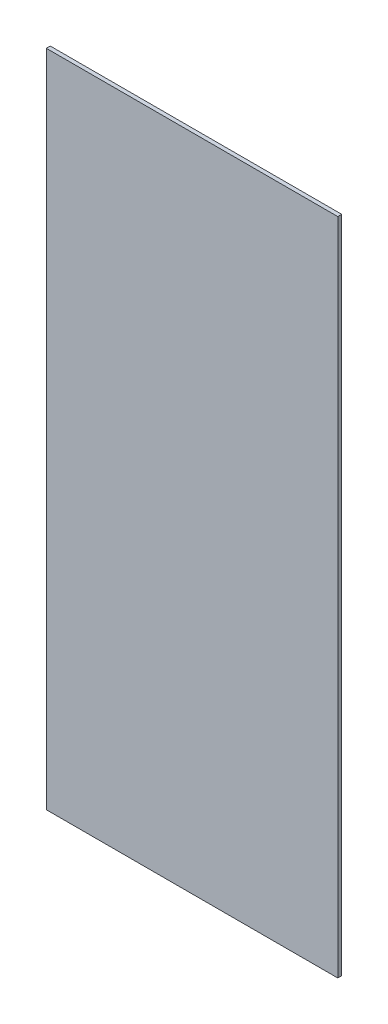
ISO-10303-21;
HEADER;
FILE_DESCRIPTION(('STEP AP214'),'2;1');
FILE_NAME('part.step','',(''),(''),'','','');
FILE_SCHEMA(('AUTOMOTIVE_DESIGN { 1 0 10303 214 1 1 1 1 }'));
ENDSEC;
DATA;
#1=APPLICATION_CONTEXT('core data for automotive mechanical design processes');
#2=APPLICATION_PROTOCOL_DEFINITION('international standard','automotive_design',2000,#1);
#3=PRODUCT_CONTEXT('',#1,'mechanical');
#4=PRODUCT('Part','Part','',(#3));
#5=PRODUCT_RELATED_PRODUCT_CATEGORY('part','',(#4));
#6=PRODUCT_DEFINITION_FORMATION('','',#4);
#7=PRODUCT_DEFINITION_CONTEXT('part definition',#1,'design');
#8=PRODUCT_DEFINITION('design','',#6,#7);
#9=PRODUCT_DEFINITION_SHAPE('','',#8);
#10=(LENGTH_UNIT() NAMED_UNIT(*) SI_UNIT(.MILLI.,.METRE.));
#11=(NAMED_UNIT(*) PLANE_ANGLE_UNIT() SI_UNIT($,.RADIAN.));
#12=(NAMED_UNIT(*) SI_UNIT($,.STERADIAN.) SOLID_ANGLE_UNIT());
#13=UNCERTAINTY_MEASURE_WITH_UNIT(LENGTH_MEASURE(1.E-05),#10,'distance_accuracy_value','');
#14=(GEOMETRIC_REPRESENTATION_CONTEXT(3) GLOBAL_UNCERTAINTY_ASSIGNED_CONTEXT((#13)) GLOBAL_UNIT_ASSIGNED_CONTEXT((#10,
#11,#12)) REPRESENTATION_CONTEXT('',''));
#15=CARTESIAN_POINT('',(0.,0.,0.));
#16=DIRECTION('',(0.,0.,1.));
#17=DIRECTION('',(1.,0.,0.));
#18=AXIS2_PLACEMENT_3D('',#15,#16,#17);
#19=CARTESIAN_POINT('',(0.,0.,1.51892));
#20=DIRECTION('',(1.,0.,0.));
#21=DIRECTION('',(0.,0.,-1.));
#22=AXIS2_PLACEMENT_3D('',#19,#20,#21);
#23=PLANE('',#22);
#24=DIRECTION('',(0.,-1.,0.));
#25=VECTOR('',#24,1.);
#26=CARTESIAN_POINT('',(0.,0.,0.));
#27=LINE('',#26,#25);
#28=CARTESIAN_POINT('',(0.,254.,0.));
#29=VERTEX_POINT('',#28);
#30=CARTESIAN_POINT('',(0.,0.,0.));
#31=VERTEX_POINT('',#30);
#32=EDGE_CURVE('E107',#29,#31,#27,.T.);
#33=ORIENTED_EDGE('',*,*,#32,.T.);
#34=DIRECTION('',(0.,0.,-1.));
#35=VECTOR('',#34,1.);
#36=CARTESIAN_POINT('',(0.,0.,1.51892));
#37=LINE('',#36,#35);
#38=CARTESIAN_POINT('',(0.,0.,1.51892));
#39=VERTEX_POINT('',#38);
#40=EDGE_CURVE('E11',#39,#31,#37,.T.);
#41=ORIENTED_EDGE('',*,*,#40,.F.);
#42=DIRECTION('',(0.,-1.,0.));
#43=VECTOR('',#42,1.);
#44=CARTESIAN_POINT('',(0.,0.,1.51892));
#45=LINE('',#44,#43);
#46=CARTESIAN_POINT('',(0.,254.,1.51892));
#47=VERTEX_POINT('',#46);
#48=EDGE_CURVE('E91',#47,#39,#45,.T.);
#49=ORIENTED_EDGE('',*,*,#48,.F.);
#50=DIRECTION('',(0.,0.,-1.));
#51=VECTOR('',#50,1.);
#52=CARTESIAN_POINT('',(0.,254.,1.51892));
#53=LINE('',#52,#51);
#54=EDGE_CURVE('E103',#47,#29,#53,.T.);
#55=ORIENTED_EDGE('',*,*,#54,.T.);
#56=EDGE_LOOP('',(#33,#41,#49,#55));
#57=FACE_BOUND('',#56,.T.);
#58=ADVANCED_FACE('F39',(#57),#23,.F.);
#59=CARTESIAN_POINT('',(0.,0.,1.51892));
#60=DIRECTION('',(0.,1.,0.));
#61=DIRECTION('',(0.,0.,1.));
#62=AXIS2_PLACEMENT_3D('',#59,#60,#61);
#63=PLANE('',#62);
#64=DIRECTION('',(1.,0.,0.));
#65=VECTOR('',#64,1.);
#66=CARTESIAN_POINT('',(0.,0.,0.));
#67=LINE('',#66,#65);
#68=CARTESIAN_POINT('',(112.268,0.,0.));
#69=VERTEX_POINT('',#68);
#70=EDGE_CURVE('E96',#31,#69,#67,.T.);
#71=ORIENTED_EDGE('',*,*,#70,.T.);
#72=DIRECTION('',(0.,0.,-1.));
#73=VECTOR('',#72,1.);
#74=CARTESIAN_POINT('',(112.268,0.,1.51892));
#75=LINE('',#74,#73);
#76=CARTESIAN_POINT('',(112.268,0.,1.51892));
#77=VERTEX_POINT('',#76);
#78=EDGE_CURVE('E48',#77,#69,#75,.T.);
#79=ORIENTED_EDGE('',*,*,#78,.F.);
#80=DIRECTION('',(1.,0.,0.));
#81=VECTOR('',#80,1.);
#82=CARTESIAN_POINT('',(0.,0.,1.51892));
#83=LINE('',#82,#81);
#84=EDGE_CURVE('E86',#39,#77,#83,.T.);
#85=ORIENTED_EDGE('',*,*,#84,.F.);
#86=ORIENTED_EDGE('',*,*,#40,.T.);
#87=EDGE_LOOP('',(#71,#79,#85,#86));
#88=FACE_BOUND('',#87,.T.);
#89=ADVANCED_FACE('F95',(#88),#63,.F.);
#90=CARTESIAN_POINT('',(112.268,0.,1.51892));
#91=DIRECTION('',(-1.,0.,0.));
#92=DIRECTION('',(0.,0.,1.));
#93=AXIS2_PLACEMENT_3D('',#90,#91,#92);
#94=PLANE('',#93);
#95=DIRECTION('',(0.,1.,0.));
#96=VECTOR('',#95,1.);
#97=CARTESIAN_POINT('',(112.268,0.,0.));
#98=LINE('',#97,#96);
#99=CARTESIAN_POINT('',(112.268,254.,0.));
#100=VERTEX_POINT('',#99);
#101=EDGE_CURVE('E73',#69,#100,#98,.T.);
#102=ORIENTED_EDGE('',*,*,#101,.T.);
#103=DIRECTION('',(0.,0.,-1.));
#104=VECTOR('',#103,1.);
#105=CARTESIAN_POINT('',(112.268,254.,1.51892));
#106=LINE('',#105,#104);
#107=CARTESIAN_POINT('',(112.268,254.,1.51892));
#108=VERTEX_POINT('',#107);
#109=EDGE_CURVE('E98',#108,#100,#106,.T.);
#110=ORIENTED_EDGE('',*,*,#109,.F.);
#111=DIRECTION('',(0.,1.,0.));
#112=VECTOR('',#111,1.);
#113=CARTESIAN_POINT('',(112.268,0.,1.51892));
#114=LINE('',#113,#112);
#115=EDGE_CURVE('E89',#77,#108,#114,.T.);
#116=ORIENTED_EDGE('',*,*,#115,.F.);
#117=ORIENTED_EDGE('',*,*,#78,.T.);
#118=EDGE_LOOP('',(#102,#110,#116,#117));
#119=FACE_BOUND('',#118,.T.);
#120=ADVANCED_FACE('F99',(#119),#94,.F.);
#121=CARTESIAN_POINT('',(0.,254.,1.51892));
#122=DIRECTION('',(0.,-1.,0.));
#123=DIRECTION('',(0.,0.,-1.));
#124=AXIS2_PLACEMENT_3D('',#121,#122,#123);
#125=PLANE('',#124);
#126=DIRECTION('',(-1.,0.,0.));
#127=VECTOR('',#126,1.);
#128=CARTESIAN_POINT('',(0.,254.,0.));
#129=LINE('',#128,#127);
#130=EDGE_CURVE('E79',#100,#29,#129,.T.);
#131=ORIENTED_EDGE('',*,*,#130,.T.);
#132=ORIENTED_EDGE('',*,*,#54,.F.);
#133=DIRECTION('',(-1.,0.,0.));
#134=VECTOR('',#133,1.);
#135=CARTESIAN_POINT('',(0.,254.,1.51892));
#136=LINE('',#135,#134);
#137=EDGE_CURVE('E56',#108,#47,#136,.T.);
#138=ORIENTED_EDGE('',*,*,#137,.F.);
#139=ORIENTED_EDGE('',*,*,#109,.T.);
#140=EDGE_LOOP('',(#131,#132,#138,#139));
#141=FACE_BOUND('',#140,.T.);
#142=ADVANCED_FACE('F120',(#141),#125,.F.);
#143=CARTESIAN_POINT('',(0.,0.,1.51892));
#144=DIRECTION('',(0.,0.,-1.));
#145=DIRECTION('',(-1.,0.,0.));
#146=AXIS2_PLACEMENT_3D('',#143,#144,#145);
#147=PLANE('',#146);
#148=ORIENTED_EDGE('',*,*,#48,.T.);
#149=ORIENTED_EDGE('',*,*,#84,.T.);
#150=ORIENTED_EDGE('',*,*,#115,.T.);
#151=ORIENTED_EDGE('',*,*,#137,.T.);
#152=EDGE_LOOP('',(#148,#149,#150,#151));
#153=FACE_BOUND('',#152,.T.);
#154=ADVANCED_FACE('F87',(#153),#147,.F.);
#155=CARTESIAN_POINT('',(0.,0.,0.));
#156=DIRECTION('',(0.,0.,-1.));
#157=DIRECTION('',(-1.,0.,0.));
#158=AXIS2_PLACEMENT_3D('',#155,#156,#157);
#159=PLANE('',#158);
#160=ORIENTED_EDGE('',*,*,#32,.F.);
#161=ORIENTED_EDGE('',*,*,#130,.F.);
#162=ORIENTED_EDGE('',*,*,#101,.F.);
#163=ORIENTED_EDGE('',*,*,#70,.F.);
#164=EDGE_LOOP('',(#160,#161,#162,#163));
#165=FACE_BOUND('',#164,.T.);
#166=ADVANCED_FACE('F123',(#165),#159,.T.);
#167=CLOSED_SHELL('',(#58,#89,#120,#142,#154,#166));
#168=MANIFOLD_SOLID_BREP('B2',#167);
#169=ADVANCED_BREP_SHAPE_REPRESENTATION('',(#18,#168),#14);
#170=SHAPE_DEFINITION_REPRESENTATION(#9,#169);
ENDSEC;
END-ISO-10303-21;
